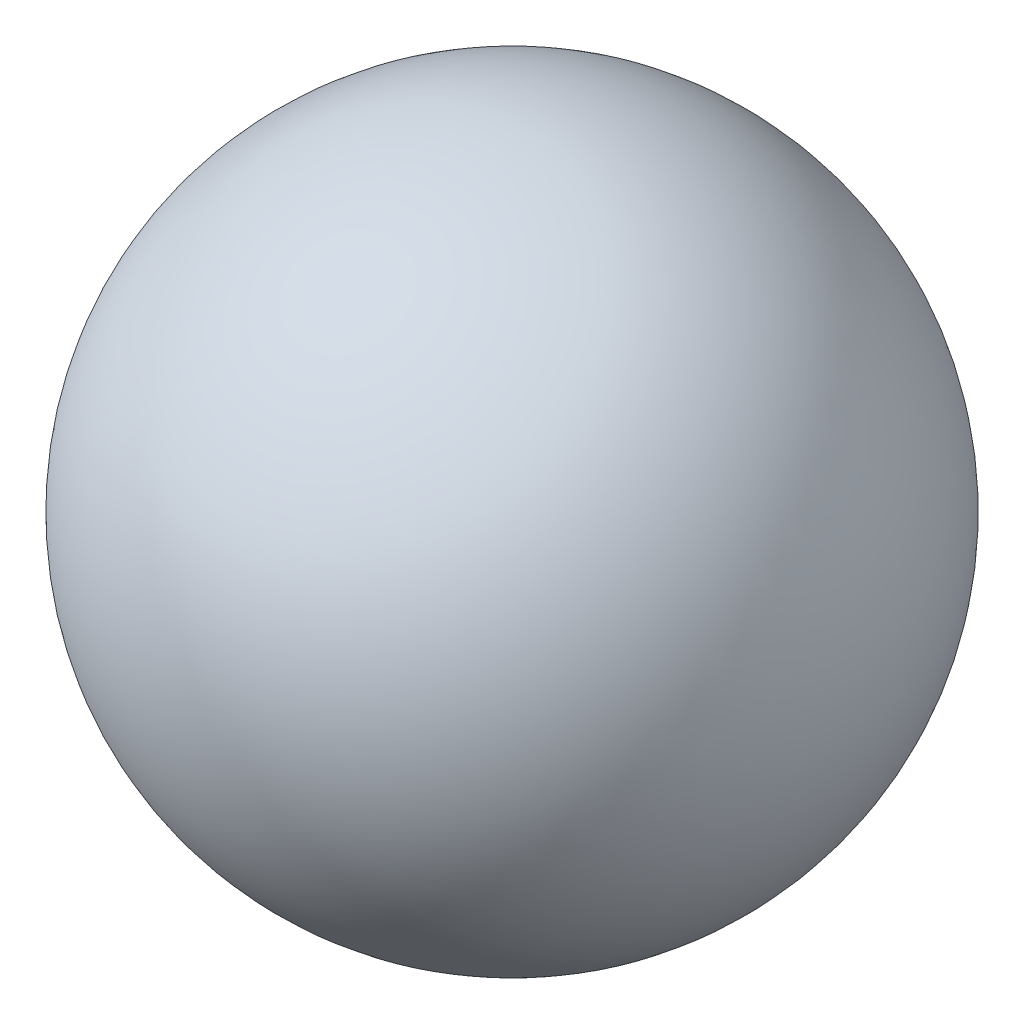
ISO-10303-21;
HEADER;
FILE_DESCRIPTION(('STEP AP214'),'2;1');
FILE_NAME('part.step','',(''),(''),'','','');
FILE_SCHEMA(('AUTOMOTIVE_DESIGN { 1 0 10303 214 1 1 1 1 }'));
ENDSEC;
DATA;
#1=APPLICATION_CONTEXT('core data for automotive mechanical design processes');
#2=APPLICATION_PROTOCOL_DEFINITION('international standard','automotive_design',2000,#1);
#3=PRODUCT_CONTEXT('',#1,'mechanical');
#4=PRODUCT('Part','Part','',(#3));
#5=PRODUCT_RELATED_PRODUCT_CATEGORY('part','',(#4));
#6=PRODUCT_DEFINITION_FORMATION('','',#4);
#7=PRODUCT_DEFINITION_CONTEXT('part definition',#1,'design');
#8=PRODUCT_DEFINITION('design','',#6,#7);
#9=PRODUCT_DEFINITION_SHAPE('','',#8);
#10=(LENGTH_UNIT() NAMED_UNIT(*) SI_UNIT(.MILLI.,.METRE.));
#11=(NAMED_UNIT(*) PLANE_ANGLE_UNIT() SI_UNIT($,.RADIAN.));
#12=(NAMED_UNIT(*) SI_UNIT($,.STERADIAN.) SOLID_ANGLE_UNIT());
#13=UNCERTAINTY_MEASURE_WITH_UNIT(LENGTH_MEASURE(1.E-05),#10,'distance_accuracy_value','');
#14=(GEOMETRIC_REPRESENTATION_CONTEXT(3) GLOBAL_UNCERTAINTY_ASSIGNED_CONTEXT((#13)) GLOBAL_UNIT_ASSIGNED_CONTEXT((#10,
#11,#12)) REPRESENTATION_CONTEXT('',''));
#15=CARTESIAN_POINT('',(0.,0.,0.));
#16=DIRECTION('',(0.,0.,1.));
#17=DIRECTION('',(1.,0.,0.));
#18=AXIS2_PLACEMENT_3D('',#15,#16,#17);
#19=CARTESIAN_POINT('',(0.,0.,0.));
#20=DIRECTION('',(0.,-1.,0.));
#21=DIRECTION('',(0.,0.,1.));
#22=AXIS2_PLACEMENT_3D('',#19,#20,#21);
#23=SPHERICAL_SURFACE('',#22,12.7);
#24=CARTESIAN_POINT('',(0.,-12.7,0.));
#25=VERTEX_POINT('',#24);
#26=VERTEX_LOOP('',#25);
#27=FACE_BOUND('',#26,.T.);
#28=ADVANCED_FACE('F29',(#27),#23,.T.);
#29=CLOSED_SHELL('',(#28));
#30=MANIFOLD_SOLID_BREP('B2',#29);
#31=ADVANCED_BREP_SHAPE_REPRESENTATION('',(#18,#30),#14);
#32=SHAPE_DEFINITION_REPRESENTATION(#9,#31);
ENDSEC;
END-ISO-10303-21;
